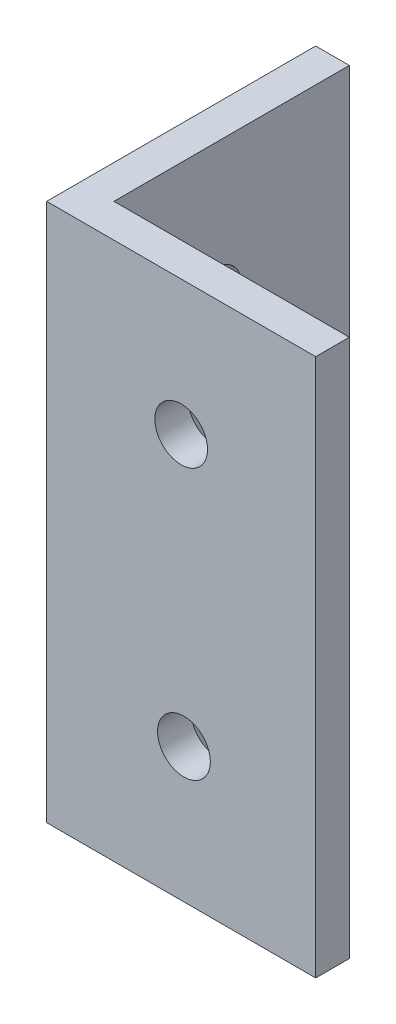
ISO-10303-21;
HEADER;
FILE_DESCRIPTION(('STEP AP214'),'2;1');
FILE_NAME('part.step','',(''),(''),'','','');
FILE_SCHEMA(('AUTOMOTIVE_DESIGN { 1 0 10303 214 1 1 1 1 }'));
ENDSEC;
DATA;
#1=APPLICATION_CONTEXT('core data for automotive mechanical design processes');
#2=APPLICATION_PROTOCOL_DEFINITION('international standard','automotive_design',2000,#1);
#3=PRODUCT_CONTEXT('',#1,'mechanical');
#4=PRODUCT('Part','Part','',(#3));
#5=PRODUCT_RELATED_PRODUCT_CATEGORY('part','',(#4));
#6=PRODUCT_DEFINITION_FORMATION('','',#4);
#7=PRODUCT_DEFINITION_CONTEXT('part definition',#1,'design');
#8=PRODUCT_DEFINITION('design','',#6,#7);
#9=PRODUCT_DEFINITION_SHAPE('','',#8);
#10=(LENGTH_UNIT() NAMED_UNIT(*) SI_UNIT(.MILLI.,.METRE.));
#11=(NAMED_UNIT(*) PLANE_ANGLE_UNIT() SI_UNIT($,.RADIAN.));
#12=(NAMED_UNIT(*) SI_UNIT($,.STERADIAN.) SOLID_ANGLE_UNIT());
#13=UNCERTAINTY_MEASURE_WITH_UNIT(LENGTH_MEASURE(1.E-05),#10,'distance_accuracy_value','');
#14=(GEOMETRIC_REPRESENTATION_CONTEXT(3) GLOBAL_UNCERTAINTY_ASSIGNED_CONTEXT((#13)) GLOBAL_UNIT_ASSIGNED_CONTEXT((#10,
#11,#12)) REPRESENTATION_CONTEXT('',''));
#15=CARTESIAN_POINT('',(0.,0.,0.));
#16=DIRECTION('',(0.,0.,1.));
#17=DIRECTION('',(1.,0.,0.));
#18=AXIS2_PLACEMENT_3D('',#15,#16,#17);
#19=CARTESIAN_POINT('',(0.,50.8,0.));
#20=DIRECTION('',(0.,0.,-1.));
#21=DIRECTION('',(-1.,0.,0.));
#22=AXIS2_PLACEMENT_3D('',#19,#20,#21);
#23=PLANE('',#22);
#24=CARTESIAN_POINT('',(12.960193372522,12.7,0.));
#25=DIRECTION('',(0.,0.,-1.));
#26=DIRECTION('',(-1.,0.,0.));
#27=AXIS2_PLACEMENT_3D('',#24,#25,#26);
#28=CIRCLE('',#27,2.48919999999999);
#29=CARTESIAN_POINT('',(10.470993372522,12.7,0.));
#30=VERTEX_POINT('',#29);
#31=EDGE_CURVE('E163',#30,#30,#28,.T.);
#32=ORIENTED_EDGE('',*,*,#31,.T.);
#33=EDGE_LOOP('',(#32));
#34=FACE_BOUND('',#33,.T.);
#35=CARTESIAN_POINT('',(12.7,38.1,0.));
#36=DIRECTION('',(0.,0.,-1.));
#37=DIRECTION('',(-1.,0.,0.));
#38=AXIS2_PLACEMENT_3D('',#35,#36,#37);
#39=CIRCLE('',#38,2.48919999999999);
#40=CARTESIAN_POINT('',(10.2108,38.1,0.));
#41=VERTEX_POINT('',#40);
#42=EDGE_CURVE('E119',#41,#41,#39,.T.);
#43=ORIENTED_EDGE('',*,*,#42,.T.);
#44=EDGE_LOOP('',(#43));
#45=FACE_BOUND('',#44,.T.);
#46=DIRECTION('',(1.,0.,0.));
#47=VECTOR('',#46,1.);
#48=CARTESIAN_POINT('',(0.,0.,0.));
#49=LINE('',#48,#47);
#50=CARTESIAN_POINT('',(0.,0.,0.));
#51=VERTEX_POINT('',#50);
#52=CARTESIAN_POINT('',(25.4,0.,0.));
#53=VERTEX_POINT('',#52);
#54=EDGE_CURVE('E115',#51,#53,#49,.T.);
#55=ORIENTED_EDGE('',*,*,#54,.T.);
#56=DIRECTION('',(0.,-1.,0.));
#57=VECTOR('',#56,1.);
#58=CARTESIAN_POINT('',(25.4,50.8,0.));
#59=LINE('',#58,#57);
#60=CARTESIAN_POINT('',(25.4,50.8,0.));
#61=VERTEX_POINT('',#60);
#62=EDGE_CURVE('E11',#61,#53,#59,.T.);
#63=ORIENTED_EDGE('',*,*,#62,.F.);
#64=DIRECTION('',(1.,0.,0.));
#65=VECTOR('',#64,1.);
#66=CARTESIAN_POINT('',(0.,50.8,0.));
#67=LINE('',#66,#65);
#68=CARTESIAN_POINT('',(0.,50.8,0.));
#69=VERTEX_POINT('',#68);
#70=EDGE_CURVE('E80',#69,#61,#67,.T.);
#71=ORIENTED_EDGE('',*,*,#70,.F.);
#72=DIRECTION('',(0.,-1.,0.));
#73=VECTOR('',#72,1.);
#74=CARTESIAN_POINT('',(0.,50.8,0.));
#75=LINE('',#74,#73);
#76=EDGE_CURVE('E111',#69,#51,#75,.T.);
#77=ORIENTED_EDGE('',*,*,#76,.T.);
#78=EDGE_LOOP('',(#55,#63,#71,#77));
#79=FACE_BOUND('',#78,.T.);
#80=ADVANCED_FACE('F34',(#34,#45,#79),#23,.F.);
#81=CARTESIAN_POINT('',(25.4,50.8,-3.175));
#82=DIRECTION('',(1.,0.,0.));
#83=DIRECTION('',(0.,0.,-1.));
#84=AXIS2_PLACEMENT_3D('',#81,#82,#83);
#85=PLANE('',#84);
#86=DIRECTION('',(0.,0.,1.));
#87=VECTOR('',#86,1.);
#88=CARTESIAN_POINT('',(25.4,0.,-3.175));
#89=LINE('',#88,#87);
#90=CARTESIAN_POINT('',(25.4,0.,-3.175));
#91=VERTEX_POINT('',#90);
#92=EDGE_CURVE('E118',#91,#53,#89,.T.);
#93=ORIENTED_EDGE('',*,*,#92,.F.);
#94=DIRECTION('',(0.,-1.,0.));
#95=VECTOR('',#94,1.);
#96=CARTESIAN_POINT('',(25.4,50.8,-3.175));
#97=LINE('',#96,#95);
#98=CARTESIAN_POINT('',(25.4,50.8,-3.175));
#99=VERTEX_POINT('',#98);
#100=EDGE_CURVE('E42',#99,#91,#97,.T.);
#101=ORIENTED_EDGE('',*,*,#100,.F.);
#102=DIRECTION('',(0.,0.,1.));
#103=VECTOR('',#102,1.);
#104=CARTESIAN_POINT('',(25.4,50.8,-3.175));
#105=LINE('',#104,#103);
#106=EDGE_CURVE('E174',#99,#61,#105,.T.);
#107=ORIENTED_EDGE('',*,*,#106,.T.);
#108=ORIENTED_EDGE('',*,*,#62,.T.);
#109=EDGE_LOOP('',(#93,#101,#107,#108));
#110=FACE_BOUND('',#109,.T.);
#111=ADVANCED_FACE('F137',(#110),#85,.T.);
#112=CARTESIAN_POINT('',(0.,50.8,-3.175));
#113=DIRECTION('',(0.,0.,-1.));
#114=DIRECTION('',(-1.,0.,0.));
#115=AXIS2_PLACEMENT_3D('',#112,#113,#114);
#116=PLANE('',#115);
#117=CARTESIAN_POINT('',(12.960193372522,12.7,-3.175));
#118=DIRECTION('',(0.,0.,-1.));
#119=DIRECTION('',(-1.,0.,0.));
#120=AXIS2_PLACEMENT_3D('',#117,#118,#119);
#121=CIRCLE('',#120,2.48919999999999);
#122=CARTESIAN_POINT('',(10.470993372522,12.7,-3.175));
#123=VERTEX_POINT('',#122);
#124=EDGE_CURVE('E176',#123,#123,#121,.T.);
#125=ORIENTED_EDGE('',*,*,#124,.F.);
#126=EDGE_LOOP('',(#125));
#127=FACE_BOUND('',#126,.T.);
#128=CARTESIAN_POINT('',(12.7,38.1,-3.175));
#129=DIRECTION('',(0.,0.,-1.));
#130=DIRECTION('',(-1.,0.,0.));
#131=AXIS2_PLACEMENT_3D('',#128,#129,#130);
#132=CIRCLE('',#131,2.48919999999999);
#133=CARTESIAN_POINT('',(10.2108,38.1,-3.175));
#134=VERTEX_POINT('',#133);
#135=EDGE_CURVE('E167',#134,#134,#132,.T.);
#136=ORIENTED_EDGE('',*,*,#135,.F.);
#137=EDGE_LOOP('',(#136));
#138=FACE_BOUND('',#137,.T.);
#139=DIRECTION('',(1.,0.,0.));
#140=VECTOR('',#139,1.);
#141=CARTESIAN_POINT('',(0.,0.,-3.175));
#142=LINE('',#141,#140);
#143=CARTESIAN_POINT('',(3.175,0.,-3.175));
#144=VERTEX_POINT('',#143);
#145=EDGE_CURVE('E122',#144,#91,#142,.T.);
#146=ORIENTED_EDGE('',*,*,#145,.F.);
#147=DIRECTION('',(0.,-1.,0.));
#148=VECTOR('',#147,1.);
#149=CARTESIAN_POINT('',(3.175,50.8,-3.175));
#150=LINE('',#149,#148);
#151=CARTESIAN_POINT('',(3.175,50.8,-3.175));
#152=VERTEX_POINT('',#151);
#153=EDGE_CURVE('E101',#152,#144,#150,.T.);
#154=ORIENTED_EDGE('',*,*,#153,.F.);
#155=DIRECTION('',(1.,0.,0.));
#156=VECTOR('',#155,1.);
#157=CARTESIAN_POINT('',(0.,50.8,-3.175));
#158=LINE('',#157,#156);
#159=EDGE_CURVE('E107',#152,#99,#158,.T.);
#160=ORIENTED_EDGE('',*,*,#159,.T.);
#161=ORIENTED_EDGE('',*,*,#100,.T.);
#162=EDGE_LOOP('',(#146,#154,#160,#161));
#163=FACE_BOUND('',#162,.T.);
#164=ADVANCED_FACE('F134',(#127,#138,#163),#116,.T.);
#165=CARTESIAN_POINT('',(3.175,50.8,0.));
#166=DIRECTION('',(1.,0.,0.));
#167=DIRECTION('',(0.,0.,-1.));
#168=AXIS2_PLACEMENT_3D('',#165,#166,#167);
#169=PLANE('',#168);
#170=CARTESIAN_POINT('',(3.175,12.7,-12.960193372522));
#171=DIRECTION('',(1.,0.,0.));
#172=DIRECTION('',(0.,0.,-1.));
#173=AXIS2_PLACEMENT_3D('',#170,#171,#172);
#174=CIRCLE('',#173,2.48919999999999);
#175=CARTESIAN_POINT('',(3.17500000000001,12.7,-15.449393372522));
#176=VERTEX_POINT('',#175);
#177=EDGE_CURVE('E187',#176,#176,#174,.T.);
#178=ORIENTED_EDGE('',*,*,#177,.F.);
#179=EDGE_LOOP('',(#178));
#180=FACE_BOUND('',#179,.T.);
#181=CARTESIAN_POINT('',(3.175,38.1,-12.7));
#182=DIRECTION('',(1.,0.,0.));
#183=DIRECTION('',(0.,0.,-1.));
#184=AXIS2_PLACEMENT_3D('',#181,#182,#183);
#185=CIRCLE('',#184,2.48919999999999);
#186=CARTESIAN_POINT('',(3.17500000000001,38.1,-15.1892));
#187=VERTEX_POINT('',#186);
#188=EDGE_CURVE('E182',#187,#187,#185,.T.);
#189=ORIENTED_EDGE('',*,*,#188,.F.);
#190=EDGE_LOOP('',(#189));
#191=FACE_BOUND('',#190,.T.);
#192=DIRECTION('',(0.,0.,-1.));
#193=VECTOR('',#192,1.);
#194=CARTESIAN_POINT('',(3.175,0.,0.));
#195=LINE('',#194,#193);
#196=CARTESIAN_POINT('',(3.175,0.,-25.4));
#197=VERTEX_POINT('',#196);
#198=EDGE_CURVE('E96',#197,#144,#195,.F.);
#199=ORIENTED_EDGE('',*,*,#198,.F.);
#200=DIRECTION('',(0.,-1.,0.));
#201=VECTOR('',#200,1.);
#202=CARTESIAN_POINT('',(3.175,50.8,-25.4));
#203=LINE('',#202,#201);
#204=CARTESIAN_POINT('',(3.175,50.8,-25.4));
#205=VERTEX_POINT('',#204);
#206=EDGE_CURVE('E91',#205,#197,#203,.T.);
#207=ORIENTED_EDGE('',*,*,#206,.F.);
#208=DIRECTION('',(0.,0.,-1.));
#209=VECTOR('',#208,1.);
#210=CARTESIAN_POINT('',(3.175,50.8,0.));
#211=LINE('',#210,#209);
#212=EDGE_CURVE('E94',#205,#152,#211,.F.);
#213=ORIENTED_EDGE('',*,*,#212,.T.);
#214=ORIENTED_EDGE('',*,*,#153,.T.);
#215=EDGE_LOOP('',(#199,#207,#213,#214));
#216=FACE_BOUND('',#215,.T.);
#217=ADVANCED_FACE('F93',(#180,#191,#216),#169,.T.);
#218=CARTESIAN_POINT('',(0.,50.8,-25.4));
#219=DIRECTION('',(0.,0.,-1.));
#220=DIRECTION('',(-1.,0.,0.));
#221=AXIS2_PLACEMENT_3D('',#218,#219,#220);
#222=PLANE('',#221);
#223=DIRECTION('',(1.,0.,0.));
#224=VECTOR('',#223,1.);
#225=CARTESIAN_POINT('',(0.,0.,-25.4));
#226=LINE('',#225,#224);
#227=CARTESIAN_POINT('',(0.,0.,-25.4));
#228=VERTEX_POINT('',#227);
#229=EDGE_CURVE('E126',#228,#197,#226,.T.);
#230=ORIENTED_EDGE('',*,*,#229,.F.);
#231=DIRECTION('',(0.,-1.,0.));
#232=VECTOR('',#231,1.);
#233=CARTESIAN_POINT('',(0.,50.8,-25.4));
#234=LINE('',#233,#232);
#235=CARTESIAN_POINT('',(0.,50.8,-25.4));
#236=VERTEX_POINT('',#235);
#237=EDGE_CURVE('E71',#236,#228,#234,.T.);
#238=ORIENTED_EDGE('',*,*,#237,.F.);
#239=DIRECTION('',(1.,0.,0.));
#240=VECTOR('',#239,1.);
#241=CARTESIAN_POINT('',(0.,50.8,-25.4));
#242=LINE('',#241,#240);
#243=EDGE_CURVE('E105',#236,#205,#242,.T.);
#244=ORIENTED_EDGE('',*,*,#243,.T.);
#245=ORIENTED_EDGE('',*,*,#206,.T.);
#246=EDGE_LOOP('',(#230,#238,#244,#245));
#247=FACE_BOUND('',#246,.T.);
#248=ADVANCED_FACE('F109',(#247),#222,.T.);
#249=CARTESIAN_POINT('',(0.,50.8,0.));
#250=DIRECTION('',(1.,0.,0.));
#251=DIRECTION('',(0.,0.,-1.));
#252=AXIS2_PLACEMENT_3D('',#249,#250,#251);
#253=PLANE('',#252);
#254=CARTESIAN_POINT('',(0.,12.7,-12.960193372522));
#255=DIRECTION('',(1.,0.,0.));
#256=DIRECTION('',(0.,0.,-1.));
#257=AXIS2_PLACEMENT_3D('',#254,#255,#256);
#258=CIRCLE('',#257,2.48919999999999);
#259=CARTESIAN_POINT('',(0.,12.7,-15.449393372522));
#260=VERTEX_POINT('',#259);
#261=EDGE_CURVE('E185',#260,#260,#258,.T.);
#262=ORIENTED_EDGE('',*,*,#261,.T.);
#263=EDGE_LOOP('',(#262));
#264=FACE_BOUND('',#263,.T.);
#265=CARTESIAN_POINT('',(0.,38.1,-12.7));
#266=DIRECTION('',(1.,0.,0.));
#267=DIRECTION('',(0.,0.,-1.));
#268=AXIS2_PLACEMENT_3D('',#265,#266,#267);
#269=CIRCLE('',#268,2.48919999999999);
#270=CARTESIAN_POINT('',(0.,38.1,-15.1892));
#271=VERTEX_POINT('',#270);
#272=EDGE_CURVE('E179',#271,#271,#269,.T.);
#273=ORIENTED_EDGE('',*,*,#272,.T.);
#274=EDGE_LOOP('',(#273));
#275=FACE_BOUND('',#274,.T.);
#276=DIRECTION('',(0.,0.,1.));
#277=VECTOR('',#276,1.);
#278=CARTESIAN_POINT('',(0.,0.,0.));
#279=LINE('',#278,#277);
#280=EDGE_CURVE('E74',#228,#51,#279,.T.);
#281=ORIENTED_EDGE('',*,*,#280,.T.);
#282=ORIENTED_EDGE('',*,*,#76,.F.);
#283=DIRECTION('',(0.,0.,1.));
#284=VECTOR('',#283,1.);
#285=CARTESIAN_POINT('',(0.,50.8,0.));
#286=LINE('',#285,#284);
#287=EDGE_CURVE('E50',#236,#69,#286,.T.);
#288=ORIENTED_EDGE('',*,*,#287,.F.);
#289=ORIENTED_EDGE('',*,*,#237,.T.);
#290=EDGE_LOOP('',(#281,#282,#288,#289));
#291=FACE_BOUND('',#290,.T.);
#292=ADVANCED_FACE('F142',(#264,#275,#291),#253,.F.);
#293=CARTESIAN_POINT('',(0.,50.8,0.));
#294=DIRECTION('',(0.,-1.,0.));
#295=DIRECTION('',(-1.,0.,0.));
#296=AXIS2_PLACEMENT_3D('',#293,#294,#295);
#297=PLANE('',#296);
#298=ORIENTED_EDGE('',*,*,#70,.T.);
#299=ORIENTED_EDGE('',*,*,#106,.F.);
#300=ORIENTED_EDGE('',*,*,#159,.F.);
#301=ORIENTED_EDGE('',*,*,#212,.F.);
#302=ORIENTED_EDGE('',*,*,#243,.F.);
#303=ORIENTED_EDGE('',*,*,#287,.T.);
#304=EDGE_LOOP('',(#298,#299,#300,#301,#302,#303));
#305=FACE_BOUND('',#304,.T.);
#306=ADVANCED_FACE('F104',(#305),#297,.F.);
#307=CARTESIAN_POINT('',(0.,0.,0.));
#308=DIRECTION('',(0.,-1.,0.));
#309=DIRECTION('',(-1.,0.,0.));
#310=AXIS2_PLACEMENT_3D('',#307,#308,#309);
#311=PLANE('',#310);
#312=ORIENTED_EDGE('',*,*,#54,.F.);
#313=ORIENTED_EDGE('',*,*,#280,.F.);
#314=ORIENTED_EDGE('',*,*,#229,.T.);
#315=ORIENTED_EDGE('',*,*,#198,.T.);
#316=ORIENTED_EDGE('',*,*,#145,.T.);
#317=ORIENTED_EDGE('',*,*,#92,.T.);
#318=EDGE_LOOP('',(#312,#313,#314,#315,#316,#317));
#319=FACE_BOUND('',#318,.T.);
#320=ADVANCED_FACE('F140',(#319),#311,.T.);
#321=CARTESIAN_POINT('',(12.7,38.1,-3.175));
#322=DIRECTION('',(0.,0.,-1.));
#323=DIRECTION('',(-1.,0.,0.));
#324=AXIS2_PLACEMENT_3D('',#321,#322,#323);
#325=CYLINDRICAL_SURFACE('',#324,2.48919999999999);
#326=ORIENTED_EDGE('',*,*,#42,.F.);
#327=EDGE_LOOP('',(#326));
#328=FACE_BOUND('',#327,.T.);
#329=ORIENTED_EDGE('',*,*,#135,.T.);
#330=EDGE_LOOP('',(#329));
#331=FACE_BOUND('',#330,.T.);
#332=ADVANCED_FACE('F209',(#328,#331),#325,.F.);
#333=CARTESIAN_POINT('',(12.960193372522,12.7,-3.175));
#334=DIRECTION('',(0.,0.,-1.));
#335=DIRECTION('',(-1.,0.,0.));
#336=AXIS2_PLACEMENT_3D('',#333,#334,#335);
#337=CYLINDRICAL_SURFACE('',#336,2.48919999999999);
#338=ORIENTED_EDGE('',*,*,#31,.F.);
#339=EDGE_LOOP('',(#338));
#340=FACE_BOUND('',#339,.T.);
#341=ORIENTED_EDGE('',*,*,#124,.T.);
#342=EDGE_LOOP('',(#341));
#343=FACE_BOUND('',#342,.T.);
#344=ADVANCED_FACE('F200',(#340,#343),#337,.F.);
#345=CARTESIAN_POINT('',(3.175,38.1,-12.7));
#346=DIRECTION('',(1.,0.,0.));
#347=DIRECTION('',(0.,0.,-1.));
#348=AXIS2_PLACEMENT_3D('',#345,#346,#347);
#349=CYLINDRICAL_SURFACE('',#348,2.48919999999999);
#350=ORIENTED_EDGE('',*,*,#272,.F.);
#351=EDGE_LOOP('',(#350));
#352=FACE_BOUND('',#351,.T.);
#353=ORIENTED_EDGE('',*,*,#188,.T.);
#354=EDGE_LOOP('',(#353));
#355=FACE_BOUND('',#354,.T.);
#356=ADVANCED_FACE('F198',(#352,#355),#349,.F.);
#357=CARTESIAN_POINT('',(3.175,12.7,-12.960193372522));
#358=DIRECTION('',(1.,0.,0.));
#359=DIRECTION('',(0.,0.,-1.));
#360=AXIS2_PLACEMENT_3D('',#357,#358,#359);
#361=CYLINDRICAL_SURFACE('',#360,2.48919999999999);
#362=ORIENTED_EDGE('',*,*,#261,.F.);
#363=EDGE_LOOP('',(#362));
#364=FACE_BOUND('',#363,.T.);
#365=ORIENTED_EDGE('',*,*,#177,.T.);
#366=EDGE_LOOP('',(#365));
#367=FACE_BOUND('',#366,.T.);
#368=ADVANCED_FACE('F191',(#364,#367),#361,.F.);
#369=CLOSED_SHELL('',(#80,#111,#164,#217,#248,#292,#306,#320,#332,#344,#356,#368));
#370=MANIFOLD_SOLID_BREP('B2',#369);
#371=ADVANCED_BREP_SHAPE_REPRESENTATION('',(#18,#370),#14);
#372=SHAPE_DEFINITION_REPRESENTATION(#9,#371);
ENDSEC;
END-ISO-10303-21;
